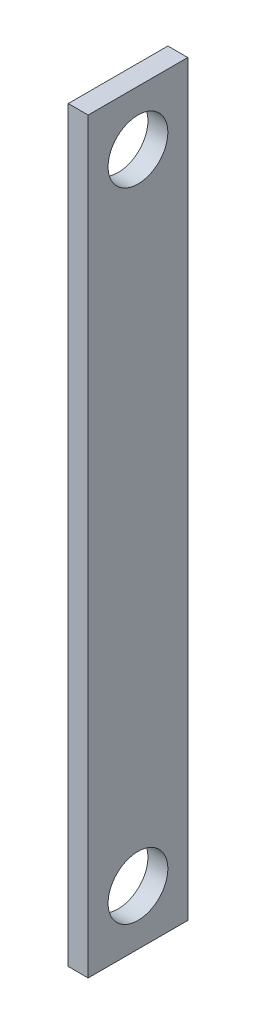
ISO-10303-21;
HEADER;
FILE_DESCRIPTION(('STEP AP214'),'2;1');
FILE_NAME('part.step','',(''),(''),'','','');
FILE_SCHEMA(('AUTOMOTIVE_DESIGN { 1 0 10303 214 1 1 1 1 }'));
ENDSEC;
DATA;
#1=APPLICATION_CONTEXT('core data for automotive mechanical design processes');
#2=APPLICATION_PROTOCOL_DEFINITION('international standard','automotive_design',2000,#1);
#3=PRODUCT_CONTEXT('',#1,'mechanical');
#4=PRODUCT('Part','Part','',(#3));
#5=PRODUCT_RELATED_PRODUCT_CATEGORY('part','',(#4));
#6=PRODUCT_DEFINITION_FORMATION('','',#4);
#7=PRODUCT_DEFINITION_CONTEXT('part definition',#1,'design');
#8=PRODUCT_DEFINITION('design','',#6,#7);
#9=PRODUCT_DEFINITION_SHAPE('','',#8);
#10=(LENGTH_UNIT() NAMED_UNIT(*) SI_UNIT(.MILLI.,.METRE.));
#11=(NAMED_UNIT(*) PLANE_ANGLE_UNIT() SI_UNIT($,.RADIAN.));
#12=(NAMED_UNIT(*) SI_UNIT($,.STERADIAN.) SOLID_ANGLE_UNIT());
#13=UNCERTAINTY_MEASURE_WITH_UNIT(LENGTH_MEASURE(1.E-05),#10,'distance_accuracy_value','');
#14=(GEOMETRIC_REPRESENTATION_CONTEXT(3) GLOBAL_UNCERTAINTY_ASSIGNED_CONTEXT((#13)) GLOBAL_UNIT_ASSIGNED_CONTEXT((#10,
#11,#12)) REPRESENTATION_CONTEXT('',''));
#15=CARTESIAN_POINT('',(0.,0.,0.));
#16=DIRECTION('',(0.,0.,1.));
#17=DIRECTION('',(1.,0.,0.));
#18=AXIS2_PLACEMENT_3D('',#15,#16,#17);
#19=CARTESIAN_POINT('',(2.,-37.5,-5.));
#20=DIRECTION('',(0.,0.,1.));
#21=DIRECTION('',(1.,0.,0.));
#22=AXIS2_PLACEMENT_3D('',#19,#20,#21);
#23=PLANE('',#22);
#24=DIRECTION('',(0.,1.,0.));
#25=VECTOR('',#24,1.);
#26=CARTESIAN_POINT('',(0.,-37.5,-5.));
#27=LINE('',#26,#25);
#28=CARTESIAN_POINT('',(0.,-37.5,-5.));
#29=VERTEX_POINT('',#28);
#30=CARTESIAN_POINT('',(0.,37.5,-5.));
#31=VERTEX_POINT('',#30);
#32=EDGE_CURVE('E96',#29,#31,#27,.T.);
#33=ORIENTED_EDGE('',*,*,#32,.T.);
#34=DIRECTION('',(-1.,0.,0.));
#35=VECTOR('',#34,1.);
#36=CARTESIAN_POINT('',(2.,37.5,-5.));
#37=LINE('',#36,#35);
#38=CARTESIAN_POINT('',(2.,37.5,-5.));
#39=VERTEX_POINT('',#38);
#40=EDGE_CURVE('E11',#39,#31,#37,.T.);
#41=ORIENTED_EDGE('',*,*,#40,.F.);
#42=DIRECTION('',(0.,1.,0.));
#43=VECTOR('',#42,1.);
#44=CARTESIAN_POINT('',(2.,-37.5,-5.));
#45=LINE('',#44,#43);
#46=CARTESIAN_POINT('',(2.,-37.5,-5.));
#47=VERTEX_POINT('',#46);
#48=EDGE_CURVE('E84',#47,#39,#45,.T.);
#49=ORIENTED_EDGE('',*,*,#48,.F.);
#50=DIRECTION('',(-1.,0.,0.));
#51=VECTOR('',#50,1.);
#52=CARTESIAN_POINT('',(2.,-37.5,-5.));
#53=LINE('',#52,#51);
#54=EDGE_CURVE('E92',#47,#29,#53,.T.);
#55=ORIENTED_EDGE('',*,*,#54,.T.);
#56=EDGE_LOOP('',(#33,#41,#49,#55));
#57=FACE_BOUND('',#56,.T.);
#58=ADVANCED_FACE('F33',(#57),#23,.F.);
#59=CARTESIAN_POINT('',(2.,37.5,5.));
#60=DIRECTION('',(0.,-1.,0.));
#61=DIRECTION('',(0.,0.,-1.));
#62=AXIS2_PLACEMENT_3D('',#59,#60,#61);
#63=PLANE('',#62);
#64=DIRECTION('',(0.,0.,1.));
#65=VECTOR('',#64,1.);
#66=CARTESIAN_POINT('',(0.,37.5,5.));
#67=LINE('',#66,#65);
#68=CARTESIAN_POINT('',(0.,37.5,5.));
#69=VERTEX_POINT('',#68);
#70=EDGE_CURVE('E88',#31,#69,#67,.T.);
#71=ORIENTED_EDGE('',*,*,#70,.T.);
#72=DIRECTION('',(-1.,0.,0.));
#73=VECTOR('',#72,1.);
#74=CARTESIAN_POINT('',(2.,37.5,5.));
#75=LINE('',#74,#73);
#76=CARTESIAN_POINT('',(2.,37.5,5.));
#77=VERTEX_POINT('',#76);
#78=EDGE_CURVE('E41',#77,#69,#75,.T.);
#79=ORIENTED_EDGE('',*,*,#78,.F.);
#80=DIRECTION('',(0.,0.,1.));
#81=VECTOR('',#80,1.);
#82=CARTESIAN_POINT('',(2.,37.5,5.));
#83=LINE('',#82,#81);
#84=EDGE_CURVE('E79',#39,#77,#83,.T.);
#85=ORIENTED_EDGE('',*,*,#84,.F.);
#86=ORIENTED_EDGE('',*,*,#40,.T.);
#87=EDGE_LOOP('',(#71,#79,#85,#86));
#88=FACE_BOUND('',#87,.T.);
#89=ADVANCED_FACE('F87',(#88),#63,.F.);
#90=CARTESIAN_POINT('',(2.,-37.5,5.));
#91=DIRECTION('',(0.,0.,-1.));
#92=DIRECTION('',(-1.,0.,0.));
#93=AXIS2_PLACEMENT_3D('',#90,#91,#92);
#94=PLANE('',#93);
#95=DIRECTION('',(0.,-1.,0.));
#96=VECTOR('',#95,1.);
#97=CARTESIAN_POINT('',(0.,-37.5,5.));
#98=LINE('',#97,#96);
#99=CARTESIAN_POINT('',(0.,-37.5,5.));
#100=VERTEX_POINT('',#99);
#101=EDGE_CURVE('E66',#69,#100,#98,.T.);
#102=ORIENTED_EDGE('',*,*,#101,.T.);
#103=DIRECTION('',(-1.,0.,0.));
#104=VECTOR('',#103,1.);
#105=CARTESIAN_POINT('',(2.,-37.5,5.));
#106=LINE('',#105,#104);
#107=CARTESIAN_POINT('',(2.,-37.5,5.));
#108=VERTEX_POINT('',#107);
#109=EDGE_CURVE('E89',#108,#100,#106,.T.);
#110=ORIENTED_EDGE('',*,*,#109,.F.);
#111=DIRECTION('',(0.,-1.,0.));
#112=VECTOR('',#111,1.);
#113=CARTESIAN_POINT('',(2.,-37.5,5.));
#114=LINE('',#113,#112);
#115=EDGE_CURVE('E82',#77,#108,#114,.T.);
#116=ORIENTED_EDGE('',*,*,#115,.F.);
#117=ORIENTED_EDGE('',*,*,#78,.T.);
#118=EDGE_LOOP('',(#102,#110,#116,#117));
#119=FACE_BOUND('',#118,.T.);
#120=ADVANCED_FACE('F90',(#119),#94,.F.);
#121=CARTESIAN_POINT('',(2.,-37.5,5.));
#122=DIRECTION('',(0.,1.,0.));
#123=DIRECTION('',(0.,0.,1.));
#124=AXIS2_PLACEMENT_3D('',#121,#122,#123);
#125=PLANE('',#124);
#126=DIRECTION('',(0.,0.,-1.));
#127=VECTOR('',#126,1.);
#128=CARTESIAN_POINT('',(0.,-37.5,5.));
#129=LINE('',#128,#127);
#130=EDGE_CURVE('E72',#100,#29,#129,.T.);
#131=ORIENTED_EDGE('',*,*,#130,.T.);
#132=ORIENTED_EDGE('',*,*,#54,.F.);
#133=DIRECTION('',(0.,0.,-1.));
#134=VECTOR('',#133,1.);
#135=CARTESIAN_POINT('',(2.,-37.5,5.));
#136=LINE('',#135,#134);
#137=EDGE_CURVE('E49',#108,#47,#136,.T.);
#138=ORIENTED_EDGE('',*,*,#137,.F.);
#139=ORIENTED_EDGE('',*,*,#109,.T.);
#140=EDGE_LOOP('',(#131,#132,#138,#139));
#141=FACE_BOUND('',#140,.T.);
#142=ADVANCED_FACE('F104',(#141),#125,.F.);
#143=CARTESIAN_POINT('',(2.,0.,0.));
#144=DIRECTION('',(-1.,0.,0.));
#145=DIRECTION('',(0.,0.,1.));
#146=AXIS2_PLACEMENT_3D('',#143,#144,#145);
#147=PLANE('',#146);
#148=CARTESIAN_POINT('',(2.,32.,0.));
#149=DIRECTION('',(1.,0.,0.));
#150=DIRECTION('',(0.,0.,-1.));
#151=AXIS2_PLACEMENT_3D('',#148,#149,#150);
#152=CIRCLE('',#151,3.);
#153=CARTESIAN_POINT('',(2.,32.,-3.));
#154=VERTEX_POINT('',#153);
#155=EDGE_CURVE('E118',#154,#154,#152,.T.);
#156=ORIENTED_EDGE('',*,*,#155,.F.);
#157=EDGE_LOOP('',(#156));
#158=FACE_BOUND('',#157,.T.);
#159=CARTESIAN_POINT('',(2.,-32.,0.));
#160=DIRECTION('',(1.,0.,0.));
#161=DIRECTION('',(0.,0.,-1.));
#162=AXIS2_PLACEMENT_3D('',#159,#160,#161);
#163=CIRCLE('',#162,3.);
#164=CARTESIAN_POINT('',(2.,-32.,-3.));
#165=VERTEX_POINT('',#164);
#166=EDGE_CURVE('E112',#165,#165,#163,.T.);
#167=ORIENTED_EDGE('',*,*,#166,.F.);
#168=EDGE_LOOP('',(#167));
#169=FACE_BOUND('',#168,.T.);
#170=ORIENTED_EDGE('',*,*,#48,.T.);
#171=ORIENTED_EDGE('',*,*,#84,.T.);
#172=ORIENTED_EDGE('',*,*,#115,.T.);
#173=ORIENTED_EDGE('',*,*,#137,.T.);
#174=EDGE_LOOP('',(#170,#171,#172,#173));
#175=FACE_BOUND('',#174,.T.);
#176=ADVANCED_FACE('F80',(#158,#169,#175),#147,.F.);
#177=CARTESIAN_POINT('',(0.,0.,0.));
#178=DIRECTION('',(-1.,0.,0.));
#179=DIRECTION('',(0.,0.,1.));
#180=AXIS2_PLACEMENT_3D('',#177,#178,#179);
#181=PLANE('',#180);
#182=CARTESIAN_POINT('',(0.,32.,0.));
#183=DIRECTION('',(-1.,0.,0.));
#184=DIRECTION('',(0.,0.,1.));
#185=AXIS2_PLACEMENT_3D('',#182,#183,#184);
#186=CIRCLE('',#185,3.);
#187=CARTESIAN_POINT('',(0.,32.,3.));
#188=VERTEX_POINT('',#187);
#189=EDGE_CURVE('E115',#188,#188,#186,.F.);
#190=ORIENTED_EDGE('',*,*,#189,.T.);
#191=EDGE_LOOP('',(#190));
#192=FACE_BOUND('',#191,.T.);
#193=CARTESIAN_POINT('',(0.,-32.,0.));
#194=DIRECTION('',(-1.,0.,0.));
#195=DIRECTION('',(0.,0.,1.));
#196=AXIS2_PLACEMENT_3D('',#193,#194,#195);
#197=CIRCLE('',#196,3.);
#198=CARTESIAN_POINT('',(0.,-32.,3.));
#199=VERTEX_POINT('',#198);
#200=EDGE_CURVE('E99',#199,#199,#197,.F.);
#201=ORIENTED_EDGE('',*,*,#200,.T.);
#202=EDGE_LOOP('',(#201));
#203=FACE_BOUND('',#202,.T.);
#204=ORIENTED_EDGE('',*,*,#32,.F.);
#205=ORIENTED_EDGE('',*,*,#130,.F.);
#206=ORIENTED_EDGE('',*,*,#101,.F.);
#207=ORIENTED_EDGE('',*,*,#70,.F.);
#208=EDGE_LOOP('',(#204,#205,#206,#207));
#209=FACE_BOUND('',#208,.T.);
#210=ADVANCED_FACE('F107',(#192,#203,#209),#181,.T.);
#211=CARTESIAN_POINT('',(-8.48528137423858,-32.,0.));
#212=DIRECTION('',(1.,0.,0.));
#213=DIRECTION('',(0.,0.,-1.));
#214=AXIS2_PLACEMENT_3D('',#211,#212,#213);
#215=CYLINDRICAL_SURFACE('',#214,3.);
#216=ORIENTED_EDGE('',*,*,#166,.T.);
#217=EDGE_LOOP('',(#216));
#218=FACE_BOUND('',#217,.T.);
#219=ORIENTED_EDGE('',*,*,#200,.F.);
#220=EDGE_LOOP('',(#219));
#221=FACE_BOUND('',#220,.T.);
#222=ADVANCED_FACE('F130',(#218,#221),#215,.F.);
#223=CARTESIAN_POINT('',(-8.48528137423858,32.,0.));
#224=DIRECTION('',(1.,0.,0.));
#225=DIRECTION('',(0.,0.,-1.));
#226=AXIS2_PLACEMENT_3D('',#223,#224,#225);
#227=CYLINDRICAL_SURFACE('',#226,3.);
#228=ORIENTED_EDGE('',*,*,#155,.T.);
#229=EDGE_LOOP('',(#228));
#230=FACE_BOUND('',#229,.T.);
#231=ORIENTED_EDGE('',*,*,#189,.F.);
#232=EDGE_LOOP('',(#231));
#233=FACE_BOUND('',#232,.T.);
#234=ADVANCED_FACE('F122',(#230,#233),#227,.F.);
#235=CLOSED_SHELL('',(#58,#89,#120,#142,#176,#210,#222,#234));
#236=MANIFOLD_SOLID_BREP('B2',#235);
#237=ADVANCED_BREP_SHAPE_REPRESENTATION('',(#18,#236),#14);
#238=SHAPE_DEFINITION_REPRESENTATION(#9,#237);
ENDSEC;
END-ISO-10303-21;
